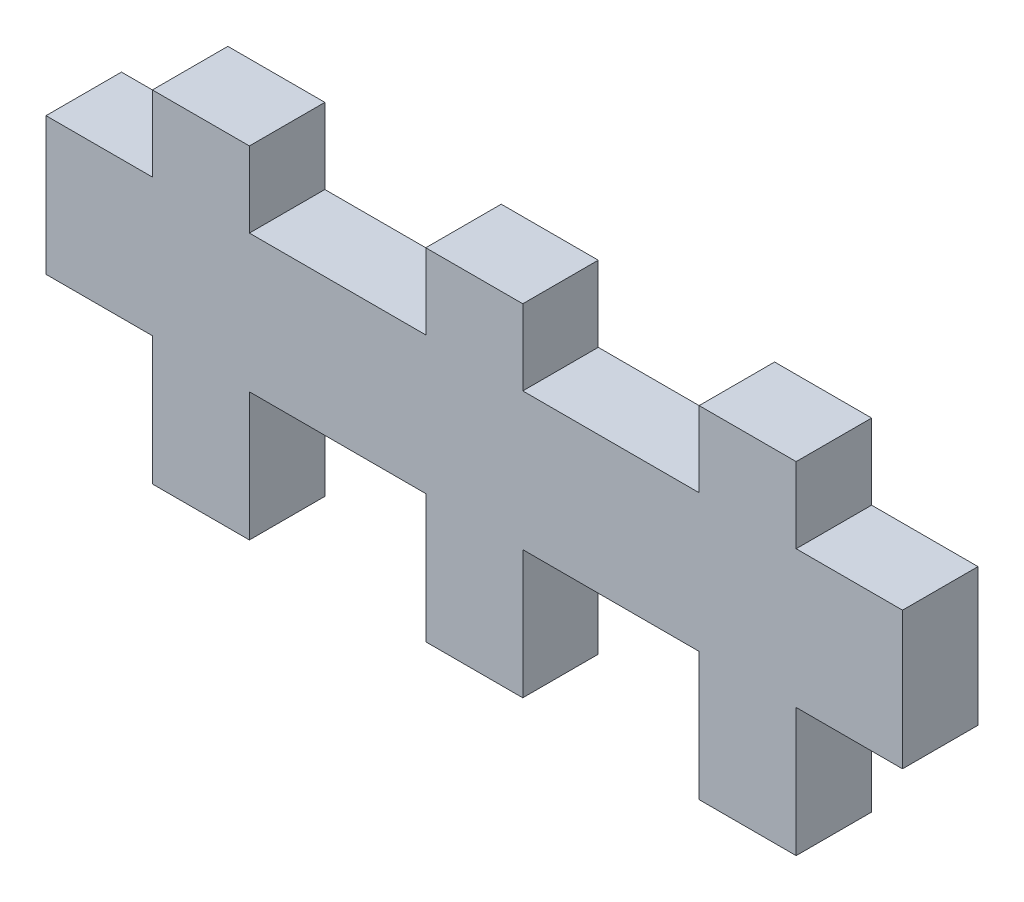
ISO-10303-21;
HEADER;
FILE_DESCRIPTION(('STEP AP214'),'2;1');
FILE_NAME('part.step','',(''),(''),'','','');
FILE_SCHEMA(('AUTOMOTIVE_DESIGN { 1 0 10303 214 1 1 1 1 }'));
ENDSEC;
DATA;
#1=APPLICATION_CONTEXT('core data for automotive mechanical design processes');
#2=APPLICATION_PROTOCOL_DEFINITION('international standard','automotive_design',2000,#1);
#3=PRODUCT_CONTEXT('',#1,'mechanical');
#4=PRODUCT('Part','Part','',(#3));
#5=PRODUCT_RELATED_PRODUCT_CATEGORY('part','',(#4));
#6=PRODUCT_DEFINITION_FORMATION('','',#4);
#7=PRODUCT_DEFINITION_CONTEXT('part definition',#1,'design');
#8=PRODUCT_DEFINITION('design','',#6,#7);
#9=PRODUCT_DEFINITION_SHAPE('','',#8);
#10=(LENGTH_UNIT() NAMED_UNIT(*) SI_UNIT(.MILLI.,.METRE.));
#11=(NAMED_UNIT(*) PLANE_ANGLE_UNIT() SI_UNIT($,.RADIAN.));
#12=(NAMED_UNIT(*) SI_UNIT($,.STERADIAN.) SOLID_ANGLE_UNIT());
#13=UNCERTAINTY_MEASURE_WITH_UNIT(LENGTH_MEASURE(1.E-05),#10,'distance_accuracy_value','');
#14=(GEOMETRIC_REPRESENTATION_CONTEXT(3) GLOBAL_UNCERTAINTY_ASSIGNED_CONTEXT((#13)) GLOBAL_UNIT_ASSIGNED_CONTEXT((#10,
#11,#12)) REPRESENTATION_CONTEXT('',''));
#15=CARTESIAN_POINT('',(0.,0.,0.));
#16=DIRECTION('',(0.,0.,1.));
#17=DIRECTION('',(1.,0.,0.));
#18=AXIS2_PLACEMENT_3D('',#15,#16,#17);
#19=CARTESIAN_POINT('',(-13.54064,8.91563999999998,0.));
#20=DIRECTION('',(-1.,0.,0.));
#21=DIRECTION('',(0.,0.,1.));
#22=AXIS2_PLACEMENT_3D('',#19,#20,#21);
#23=PLANE('',#22);
#24=DIRECTION('',(0.,-1.,0.));
#25=VECTOR('',#24,1.);
#26=CARTESIAN_POINT('',(-13.54064,8.91563999999998,3.175));
#27=LINE('',#26,#25);
#28=CARTESIAN_POINT('',(-13.54064,8.91563999999998,3.175));
#29=VERTEX_POINT('',#28);
#30=CARTESIAN_POINT('',(-13.54064,5.74063999999999,3.175));
#31=VERTEX_POINT('',#30);
#32=EDGE_CURVE('E255',#29,#31,#27,.T.);
#33=ORIENTED_EDGE('',*,*,#32,.F.);
#34=DIRECTION('',(0.,0.,1.));
#35=VECTOR('',#34,1.);
#36=CARTESIAN_POINT('',(-13.54064,8.91563999999998,0.));
#37=LINE('',#36,#35);
#38=CARTESIAN_POINT('',(-13.54064,8.91563999999998,0.));
#39=VERTEX_POINT('',#38);
#40=EDGE_CURVE('E11',#39,#29,#37,.T.);
#41=ORIENTED_EDGE('',*,*,#40,.F.);
#42=DIRECTION('',(0.,-1.,0.));
#43=VECTOR('',#42,1.);
#44=CARTESIAN_POINT('',(-13.54064,8.91563999999998,0.));
#45=LINE('',#44,#43);
#46=CARTESIAN_POINT('',(-13.54064,5.74063999999999,0.));
#47=VERTEX_POINT('',#46);
#48=EDGE_CURVE('E335',#39,#47,#45,.T.);
#49=ORIENTED_EDGE('',*,*,#48,.T.);
#50=DIRECTION('',(0.,0.,1.));
#51=VECTOR('',#50,1.);
#52=CARTESIAN_POINT('',(-13.54064,5.74063999999999,0.));
#53=LINE('',#52,#51);
#54=EDGE_CURVE('E42',#47,#31,#53,.T.);
#55=ORIENTED_EDGE('',*,*,#54,.T.);
#56=EDGE_LOOP('',(#33,#41,#49,#55));
#57=FACE_BOUND('',#56,.T.);
#58=ADVANCED_FACE('F38',(#57),#23,.T.);
#59=CARTESIAN_POINT('',(-9.45936000000001,8.91563999999998,0.));
#60=DIRECTION('',(0.,1.,0.));
#61=DIRECTION('',(-1.,0.,0.));
#62=AXIS2_PLACEMENT_3D('',#59,#60,#61);
#63=PLANE('',#62);
#64=DIRECTION('',(-1.,0.,0.));
#65=VECTOR('',#64,1.);
#66=CARTESIAN_POINT('',(-9.45936000000001,8.91563999999998,3.175));
#67=LINE('',#66,#65);
#68=CARTESIAN_POINT('',(-9.45936000000001,8.91563999999998,3.175));
#69=VERTEX_POINT('',#68);
#70=EDGE_CURVE('E333',#69,#29,#67,.T.);
#71=ORIENTED_EDGE('',*,*,#70,.F.);
#72=DIRECTION('',(0.,0.,1.));
#73=VECTOR('',#72,1.);
#74=CARTESIAN_POINT('',(-9.45936000000001,8.91563999999998,0.));
#75=LINE('',#74,#73);
#76=CARTESIAN_POINT('',(-9.45936000000001,8.91563999999998,0.));
#77=VERTEX_POINT('',#76);
#78=EDGE_CURVE('E48',#77,#69,#75,.T.);
#79=ORIENTED_EDGE('',*,*,#78,.F.);
#80=DIRECTION('',(-1.,0.,0.));
#81=VECTOR('',#80,1.);
#82=CARTESIAN_POINT('',(-9.45936000000001,8.91563999999998,0.));
#83=LINE('',#82,#81);
#84=EDGE_CURVE('E245',#77,#39,#83,.T.);
#85=ORIENTED_EDGE('',*,*,#84,.T.);
#86=ORIENTED_EDGE('',*,*,#40,.T.);
#87=EDGE_LOOP('',(#71,#79,#85,#86));
#88=FACE_BOUND('',#87,.T.);
#89=ADVANCED_FACE('F387',(#88),#63,.T.);
#90=CARTESIAN_POINT('',(-9.45936000000001,5.74063999999999,0.));
#91=DIRECTION('',(1.,0.,0.));
#92=DIRECTION('',(0.,0.,-1.));
#93=AXIS2_PLACEMENT_3D('',#90,#91,#92);
#94=PLANE('',#93);
#95=DIRECTION('',(0.,1.,0.));
#96=VECTOR('',#95,1.);
#97=CARTESIAN_POINT('',(-9.45936000000001,5.74063999999999,3.175));
#98=LINE('',#97,#96);
#99=CARTESIAN_POINT('',(-9.45936000000001,5.74063999999999,3.175));
#100=VERTEX_POINT('',#99);
#101=EDGE_CURVE('E233',#100,#69,#98,.T.);
#102=ORIENTED_EDGE('',*,*,#101,.F.);
#103=DIRECTION('',(0.,0.,1.));
#104=VECTOR('',#103,1.);
#105=CARTESIAN_POINT('',(-9.45936000000001,5.74063999999999,0.));
#106=LINE('',#105,#104);
#107=CARTESIAN_POINT('',(-9.45936000000001,5.74063999999999,0.));
#108=VERTEX_POINT('',#107);
#109=EDGE_CURVE('E228',#108,#100,#106,.T.);
#110=ORIENTED_EDGE('',*,*,#109,.F.);
#111=DIRECTION('',(0.,1.,0.));
#112=VECTOR('',#111,1.);
#113=CARTESIAN_POINT('',(-9.45936000000001,5.74063999999999,0.));
#114=LINE('',#113,#112);
#115=EDGE_CURVE('E231',#108,#77,#114,.T.);
#116=ORIENTED_EDGE('',*,*,#115,.T.);
#117=ORIENTED_EDGE('',*,*,#78,.T.);
#118=EDGE_LOOP('',(#102,#110,#116,#117));
#119=FACE_BOUND('',#118,.T.);
#120=ADVANCED_FACE('F230',(#119),#94,.T.);
#121=CARTESIAN_POINT('',(-2.04063999999999,5.74063999999999,0.));
#122=DIRECTION('',(0.,1.,0.));
#123=DIRECTION('',(0.,0.,1.));
#124=AXIS2_PLACEMENT_3D('',#121,#122,#123);
#125=PLANE('',#124);
#126=DIRECTION('',(-1.,0.,0.));
#127=VECTOR('',#126,1.);
#128=CARTESIAN_POINT('',(-2.04063999999999,5.74063999999999,3.175));
#129=LINE('',#128,#127);
#130=CARTESIAN_POINT('',(-2.04063999999999,5.74063999999999,3.175));
#131=VERTEX_POINT('',#130);
#132=EDGE_CURVE('E330',#131,#100,#129,.T.);
#133=ORIENTED_EDGE('',*,*,#132,.F.);
#134=DIRECTION('',(0.,0.,1.));
#135=VECTOR('',#134,1.);
#136=CARTESIAN_POINT('',(-2.04063999999999,5.74063999999999,0.));
#137=LINE('',#136,#135);
#138=CARTESIAN_POINT('',(-2.04063999999999,5.74063999999999,0.));
#139=VERTEX_POINT('',#138);
#140=EDGE_CURVE('E238',#139,#131,#137,.T.);
#141=ORIENTED_EDGE('',*,*,#140,.F.);
#142=DIRECTION('',(-1.,0.,0.));
#143=VECTOR('',#142,1.);
#144=CARTESIAN_POINT('',(-2.04063999999999,5.74063999999999,0.));
#145=LINE('',#144,#143);
#146=EDGE_CURVE('E243',#139,#108,#145,.T.);
#147=ORIENTED_EDGE('',*,*,#146,.T.);
#148=ORIENTED_EDGE('',*,*,#109,.T.);
#149=EDGE_LOOP('',(#133,#141,#147,#148));
#150=FACE_BOUND('',#149,.T.);
#151=ADVANCED_FACE('F247',(#150),#125,.T.);
#152=CARTESIAN_POINT('',(-2.04063999999999,8.91563999999999,0.));
#153=DIRECTION('',(-1.,0.,0.));
#154=DIRECTION('',(0.,-1.,0.));
#155=AXIS2_PLACEMENT_3D('',#152,#153,#154);
#156=PLANE('',#155);
#157=DIRECTION('',(0.,-1.,0.));
#158=VECTOR('',#157,1.);
#159=CARTESIAN_POINT('',(-2.04063999999999,8.91563999999999,3.175));
#160=LINE('',#159,#158);
#161=CARTESIAN_POINT('',(-2.04063999999999,8.91563999999999,3.175));
#162=VERTEX_POINT('',#161);
#163=EDGE_CURVE('E327',#162,#131,#160,.T.);
#164=ORIENTED_EDGE('',*,*,#163,.F.);
#165=DIRECTION('',(0.,0.,1.));
#166=VECTOR('',#165,1.);
#167=CARTESIAN_POINT('',(-2.04063999999999,8.91563999999999,0.));
#168=LINE('',#167,#166);
#169=CARTESIAN_POINT('',(-2.04063999999999,8.91563999999999,0.));
#170=VERTEX_POINT('',#169);
#171=EDGE_CURVE('E339',#170,#162,#168,.T.);
#172=ORIENTED_EDGE('',*,*,#171,.F.);
#173=DIRECTION('',(0.,-1.,0.));
#174=VECTOR('',#173,1.);
#175=CARTESIAN_POINT('',(-2.04063999999999,8.91563999999999,0.));
#176=LINE('',#175,#174);
#177=EDGE_CURVE('E248',#170,#139,#176,.T.);
#178=ORIENTED_EDGE('',*,*,#177,.T.);
#179=ORIENTED_EDGE('',*,*,#140,.T.);
#180=EDGE_LOOP('',(#164,#172,#178,#179));
#181=FACE_BOUND('',#180,.T.);
#182=ADVANCED_FACE('F399',(#181),#156,.T.);
#183=CARTESIAN_POINT('',(2.04063999999999,8.91563999999999,0.));
#184=DIRECTION('',(0.,1.,0.));
#185=DIRECTION('',(0.,0.,1.));
#186=AXIS2_PLACEMENT_3D('',#183,#184,#185);
#187=PLANE('',#186);
#188=DIRECTION('',(-1.,0.,0.));
#189=VECTOR('',#188,1.);
#190=CARTESIAN_POINT('',(2.04063999999999,8.91563999999999,3.175));
#191=LINE('',#190,#189);
#192=CARTESIAN_POINT('',(2.04063999999999,8.91563999999999,3.175));
#193=VERTEX_POINT('',#192);
#194=EDGE_CURVE('E324',#193,#162,#191,.T.);
#195=ORIENTED_EDGE('',*,*,#194,.F.);
#196=DIRECTION('',(0.,0.,1.));
#197=VECTOR('',#196,1.);
#198=CARTESIAN_POINT('',(2.04063999999999,8.91563999999999,0.));
#199=LINE('',#198,#197);
#200=CARTESIAN_POINT('',(2.04063999999999,8.91563999999999,0.));
#201=VERTEX_POINT('',#200);
#202=EDGE_CURVE('E341',#201,#193,#199,.T.);
#203=ORIENTED_EDGE('',*,*,#202,.F.);
#204=DIRECTION('',(-1.,0.,0.));
#205=VECTOR('',#204,1.);
#206=CARTESIAN_POINT('',(2.04063999999999,8.91563999999999,0.));
#207=LINE('',#206,#205);
#208=EDGE_CURVE('E250',#201,#170,#207,.T.);
#209=ORIENTED_EDGE('',*,*,#208,.T.);
#210=ORIENTED_EDGE('',*,*,#171,.T.);
#211=EDGE_LOOP('',(#195,#203,#209,#210));
#212=FACE_BOUND('',#211,.T.);
#213=ADVANCED_FACE('F402',(#212),#187,.T.);
#214=CARTESIAN_POINT('',(2.04063999999999,5.74063999999999,0.));
#215=DIRECTION('',(1.,0.,0.));
#216=DIRECTION('',(0.,1.,0.));
#217=AXIS2_PLACEMENT_3D('',#214,#215,#216);
#218=PLANE('',#217);
#219=DIRECTION('',(0.,1.,0.));
#220=VECTOR('',#219,1.);
#221=CARTESIAN_POINT('',(2.04063999999999,5.74063999999999,3.175));
#222=LINE('',#221,#220);
#223=CARTESIAN_POINT('',(2.04063999999999,5.74063999999999,3.175));
#224=VERTEX_POINT('',#223);
#225=EDGE_CURVE('E321',#224,#193,#222,.T.);
#226=ORIENTED_EDGE('',*,*,#225,.F.);
#227=DIRECTION('',(0.,0.,1.));
#228=VECTOR('',#227,1.);
#229=CARTESIAN_POINT('',(2.04063999999999,5.74063999999999,0.));
#230=LINE('',#229,#228);
#231=CARTESIAN_POINT('',(2.04063999999999,5.74063999999999,0.));
#232=VERTEX_POINT('',#231);
#233=EDGE_CURVE('E343',#232,#224,#230,.T.);
#234=ORIENTED_EDGE('',*,*,#233,.F.);
#235=DIRECTION('',(0.,1.,0.));
#236=VECTOR('',#235,1.);
#237=CARTESIAN_POINT('',(2.04063999999999,5.74063999999999,0.));
#238=LINE('',#237,#236);
#239=EDGE_CURVE('E808',#232,#201,#238,.T.);
#240=ORIENTED_EDGE('',*,*,#239,.T.);
#241=ORIENTED_EDGE('',*,*,#202,.T.);
#242=EDGE_LOOP('',(#226,#234,#240,#241));
#243=FACE_BOUND('',#242,.T.);
#244=ADVANCED_FACE('F406',(#243),#218,.T.);
#245=CARTESIAN_POINT('',(9.45936000000007,5.74063999999999,0.));
#246=DIRECTION('',(0.,1.,0.));
#247=DIRECTION('',(0.,0.,1.));
#248=AXIS2_PLACEMENT_3D('',#245,#246,#247);
#249=PLANE('',#248);
#250=DIRECTION('',(-1.,0.,0.));
#251=VECTOR('',#250,1.);
#252=CARTESIAN_POINT('',(9.45936000000007,5.74063999999999,3.175));
#253=LINE('',#252,#251);
#254=CARTESIAN_POINT('',(9.45936000000007,5.74063999999999,3.175));
#255=VERTEX_POINT('',#254);
#256=EDGE_CURVE('E318',#255,#224,#253,.T.);
#257=ORIENTED_EDGE('',*,*,#256,.F.);
#258=DIRECTION('',(0.,0.,1.));
#259=VECTOR('',#258,1.);
#260=CARTESIAN_POINT('',(9.45936000000007,5.74063999999999,0.));
#261=LINE('',#260,#259);
#262=CARTESIAN_POINT('',(9.45936000000007,5.74063999999999,0.));
#263=VERTEX_POINT('',#262);
#264=EDGE_CURVE('E345',#263,#255,#261,.T.);
#265=ORIENTED_EDGE('',*,*,#264,.F.);
#266=DIRECTION('',(-1.,0.,0.));
#267=VECTOR('',#266,1.);
#268=CARTESIAN_POINT('',(9.45936000000007,5.74063999999999,0.));
#269=LINE('',#268,#267);
#270=EDGE_CURVE('E804',#263,#232,#269,.T.);
#271=ORIENTED_EDGE('',*,*,#270,.T.);
#272=ORIENTED_EDGE('',*,*,#233,.T.);
#273=EDGE_LOOP('',(#257,#265,#271,#272));
#274=FACE_BOUND('',#273,.T.);
#275=ADVANCED_FACE('F410',(#274),#249,.T.);
#276=CARTESIAN_POINT('',(9.45936000000007,8.91563999999998,0.));
#277=DIRECTION('',(-1.,0.,0.));
#278=DIRECTION('',(0.,0.,1.));
#279=AXIS2_PLACEMENT_3D('',#276,#277,#278);
#280=PLANE('',#279);
#281=DIRECTION('',(0.,-1.,0.));
#282=VECTOR('',#281,1.);
#283=CARTESIAN_POINT('',(9.45936000000007,8.91563999999998,3.175));
#284=LINE('',#283,#282);
#285=CARTESIAN_POINT('',(9.45936000000007,8.91563999999998,3.175));
#286=VERTEX_POINT('',#285);
#287=EDGE_CURVE('E315',#286,#255,#284,.T.);
#288=ORIENTED_EDGE('',*,*,#287,.F.);
#289=DIRECTION('',(0.,0.,1.));
#290=VECTOR('',#289,1.);
#291=CARTESIAN_POINT('',(9.45936000000007,8.91563999999998,0.));
#292=LINE('',#291,#290);
#293=CARTESIAN_POINT('',(9.45936000000007,8.91563999999998,0.));
#294=VERTEX_POINT('',#293);
#295=EDGE_CURVE('E347',#294,#286,#292,.T.);
#296=ORIENTED_EDGE('',*,*,#295,.F.);
#297=DIRECTION('',(0.,-1.,0.));
#298=VECTOR('',#297,1.);
#299=CARTESIAN_POINT('',(9.45936000000007,8.91563999999998,0.));
#300=LINE('',#299,#298);
#301=EDGE_CURVE('E815',#294,#263,#300,.T.);
#302=ORIENTED_EDGE('',*,*,#301,.T.);
#303=ORIENTED_EDGE('',*,*,#264,.T.);
#304=EDGE_LOOP('',(#288,#296,#302,#303));
#305=FACE_BOUND('',#304,.T.);
#306=ADVANCED_FACE('F414',(#305),#280,.T.);
#307=CARTESIAN_POINT('',(13.5406400000001,8.91563999999997,0.));
#308=DIRECTION('',(0.,1.,0.));
#309=DIRECTION('',(-1.,0.,0.));
#310=AXIS2_PLACEMENT_3D('',#307,#308,#309);
#311=PLANE('',#310);
#312=DIRECTION('',(-1.,0.,0.));
#313=VECTOR('',#312,1.);
#314=CARTESIAN_POINT('',(13.5406400000001,8.91563999999997,3.175));
#315=LINE('',#314,#313);
#316=CARTESIAN_POINT('',(13.5406400000001,8.91563999999997,3.175));
#317=VERTEX_POINT('',#316);
#318=EDGE_CURVE('E312',#317,#286,#315,.T.);
#319=ORIENTED_EDGE('',*,*,#318,.F.);
#320=DIRECTION('',(0.,0.,1.));
#321=VECTOR('',#320,1.);
#322=CARTESIAN_POINT('',(13.5406400000001,8.91563999999997,0.));
#323=LINE('',#322,#321);
#324=CARTESIAN_POINT('',(13.5406400000001,8.91563999999997,0.));
#325=VERTEX_POINT('',#324);
#326=EDGE_CURVE('E349',#325,#317,#323,.T.);
#327=ORIENTED_EDGE('',*,*,#326,.F.);
#328=DIRECTION('',(-1.,0.,0.));
#329=VECTOR('',#328,1.);
#330=CARTESIAN_POINT('',(13.5406400000001,8.91563999999997,0.));
#331=LINE('',#330,#329);
#332=EDGE_CURVE('E797',#325,#294,#331,.T.);
#333=ORIENTED_EDGE('',*,*,#332,.T.);
#334=ORIENTED_EDGE('',*,*,#295,.T.);
#335=EDGE_LOOP('',(#319,#327,#333,#334));
#336=FACE_BOUND('',#335,.T.);
#337=ADVANCED_FACE('F418',(#336),#311,.T.);
#338=CARTESIAN_POINT('',(13.5406400000001,5.74063999999999,0.));
#339=DIRECTION('',(1.,0.,0.));
#340=DIRECTION('',(0.,1.,0.));
#341=AXIS2_PLACEMENT_3D('',#338,#339,#340);
#342=PLANE('',#341);
#343=DIRECTION('',(0.,1.,0.));
#344=VECTOR('',#343,1.);
#345=CARTESIAN_POINT('',(13.5406400000001,5.74063999999999,3.175));
#346=LINE('',#345,#344);
#347=CARTESIAN_POINT('',(13.5406400000001,5.74063999999999,3.175));
#348=VERTEX_POINT('',#347);
#349=EDGE_CURVE('E309',#348,#317,#346,.T.);
#350=ORIENTED_EDGE('',*,*,#349,.F.);
#351=DIRECTION('',(0.,0.,1.));
#352=VECTOR('',#351,1.);
#353=CARTESIAN_POINT('',(13.5406400000001,5.74063999999999,0.));
#354=LINE('',#353,#352);
#355=CARTESIAN_POINT('',(13.5406400000001,5.74063999999999,0.));
#356=VERTEX_POINT('',#355);
#357=EDGE_CURVE('E351',#356,#348,#354,.T.);
#358=ORIENTED_EDGE('',*,*,#357,.F.);
#359=DIRECTION('',(0.,1.,0.));
#360=VECTOR('',#359,1.);
#361=CARTESIAN_POINT('',(13.5406400000001,5.74063999999999,0.));
#362=LINE('',#361,#360);
#363=EDGE_CURVE('E793',#356,#325,#362,.T.);
#364=ORIENTED_EDGE('',*,*,#363,.T.);
#365=ORIENTED_EDGE('',*,*,#326,.T.);
#366=EDGE_LOOP('',(#350,#358,#364,#365));
#367=FACE_BOUND('',#366,.T.);
#368=ADVANCED_FACE('F422',(#367),#342,.T.);
#369=CARTESIAN_POINT('',(18.01564,5.74063999999999,0.));
#370=DIRECTION('',(0.,1.,0.));
#371=DIRECTION('',(0.,0.,1.));
#372=AXIS2_PLACEMENT_3D('',#369,#370,#371);
#373=PLANE('',#372);
#374=DIRECTION('',(-1.,0.,0.));
#375=VECTOR('',#374,1.);
#376=CARTESIAN_POINT('',(18.01564,5.74063999999999,3.175));
#377=LINE('',#376,#375);
#378=CARTESIAN_POINT('',(18.01564,5.74063999999999,3.175));
#379=VERTEX_POINT('',#378);
#380=EDGE_CURVE('E306',#379,#348,#377,.T.);
#381=ORIENTED_EDGE('',*,*,#380,.F.);
#382=DIRECTION('',(0.,0.,1.));
#383=VECTOR('',#382,1.);
#384=CARTESIAN_POINT('',(18.01564,5.74063999999999,0.));
#385=LINE('',#384,#383);
#386=CARTESIAN_POINT('',(18.01564,5.74063999999999,0.));
#387=VERTEX_POINT('',#386);
#388=EDGE_CURVE('E353',#387,#379,#385,.T.);
#389=ORIENTED_EDGE('',*,*,#388,.F.);
#390=DIRECTION('',(-1.,0.,0.));
#391=VECTOR('',#390,1.);
#392=CARTESIAN_POINT('',(18.01564,5.74063999999999,0.));
#393=LINE('',#392,#391);
#394=EDGE_CURVE('E819',#387,#356,#393,.T.);
#395=ORIENTED_EDGE('',*,*,#394,.T.);
#396=ORIENTED_EDGE('',*,*,#357,.T.);
#397=EDGE_LOOP('',(#381,#389,#395,#396));
#398=FACE_BOUND('',#397,.T.);
#399=ADVANCED_FACE('F426',(#398),#373,.T.);
#400=CARTESIAN_POINT('',(18.01564,-0.04064,0.));
#401=DIRECTION('',(1.,0.,0.));
#402=DIRECTION('',(0.,0.,-1.));
#403=AXIS2_PLACEMENT_3D('',#400,#401,#402);
#404=PLANE('',#403);
#405=DIRECTION('',(0.,1.,0.));
#406=VECTOR('',#405,1.);
#407=CARTESIAN_POINT('',(18.01564,-0.04064,3.175));
#408=LINE('',#407,#406);
#409=CARTESIAN_POINT('',(18.01564,-0.04064,3.175));
#410=VERTEX_POINT('',#409);
#411=EDGE_CURVE('E303',#410,#379,#408,.T.);
#412=ORIENTED_EDGE('',*,*,#411,.F.);
#413=DIRECTION('',(0.,0.,1.));
#414=VECTOR('',#413,1.);
#415=CARTESIAN_POINT('',(18.01564,-0.04064,0.));
#416=LINE('',#415,#414);
#417=CARTESIAN_POINT('',(18.01564,-0.04064,0.));
#418=VERTEX_POINT('',#417);
#419=EDGE_CURVE('E355',#418,#410,#416,.T.);
#420=ORIENTED_EDGE('',*,*,#419,.F.);
#421=DIRECTION('',(0.,1.,0.));
#422=VECTOR('',#421,1.);
#423=CARTESIAN_POINT('',(18.01564,-0.04064,0.));
#424=LINE('',#423,#422);
#425=EDGE_CURVE('E786',#418,#387,#424,.T.);
#426=ORIENTED_EDGE('',*,*,#425,.T.);
#427=ORIENTED_EDGE('',*,*,#388,.T.);
#428=EDGE_LOOP('',(#412,#420,#426,#427));
#429=FACE_BOUND('',#428,.T.);
#430=ADVANCED_FACE('F430',(#429),#404,.T.);
#431=CARTESIAN_POINT('',(13.5406400000001,-0.04064,0.));
#432=DIRECTION('',(0.,-1.,0.));
#433=DIRECTION('',(0.,0.,-1.));
#434=AXIS2_PLACEMENT_3D('',#431,#432,#433);
#435=PLANE('',#434);
#436=DIRECTION('',(1.,0.,0.));
#437=VECTOR('',#436,1.);
#438=CARTESIAN_POINT('',(13.5406400000001,-0.04064,3.175));
#439=LINE('',#438,#437);
#440=CARTESIAN_POINT('',(13.5406400000001,-0.04064,3.175));
#441=VERTEX_POINT('',#440);
#442=EDGE_CURVE('E300',#441,#410,#439,.T.);
#443=ORIENTED_EDGE('',*,*,#442,.F.);
#444=DIRECTION('',(0.,0.,1.));
#445=VECTOR('',#444,1.);
#446=CARTESIAN_POINT('',(13.5406400000001,-0.04064,0.));
#447=LINE('',#446,#445);
#448=CARTESIAN_POINT('',(13.5406400000001,-0.04064,0.));
#449=VERTEX_POINT('',#448);
#450=EDGE_CURVE('E357',#449,#441,#447,.T.);
#451=ORIENTED_EDGE('',*,*,#450,.F.);
#452=DIRECTION('',(1.,0.,0.));
#453=VECTOR('',#452,1.);
#454=CARTESIAN_POINT('',(13.5406400000001,-0.04064,0.));
#455=LINE('',#454,#453);
#456=EDGE_CURVE('E782',#449,#418,#455,.T.);
#457=ORIENTED_EDGE('',*,*,#456,.T.);
#458=ORIENTED_EDGE('',*,*,#419,.T.);
#459=EDGE_LOOP('',(#443,#451,#457,#458));
#460=FACE_BOUND('',#459,.T.);
#461=ADVANCED_FACE('F434',(#460),#435,.T.);
#462=CARTESIAN_POINT('',(13.54064,-5.44064,0.));
#463=DIRECTION('',(1.,0.,0.));
#464=DIRECTION('',(0.,1.,0.));
#465=AXIS2_PLACEMENT_3D('',#462,#463,#464);
#466=PLANE('',#465);
#467=DIRECTION('',(0.,1.,0.));
#468=VECTOR('',#467,1.);
#469=CARTESIAN_POINT('',(13.54064,-5.44064,3.175));
#470=LINE('',#469,#468);
#471=CARTESIAN_POINT('',(13.54064,-5.44064,3.175));
#472=VERTEX_POINT('',#471);
#473=EDGE_CURVE('E297',#472,#441,#470,.T.);
#474=ORIENTED_EDGE('',*,*,#473,.F.);
#475=DIRECTION('',(0.,0.,1.));
#476=VECTOR('',#475,1.);
#477=CARTESIAN_POINT('',(13.54064,-5.44064,0.));
#478=LINE('',#477,#476);
#479=CARTESIAN_POINT('',(13.54064,-5.44064,0.));
#480=VERTEX_POINT('',#479);
#481=EDGE_CURVE('E359',#480,#472,#478,.T.);
#482=ORIENTED_EDGE('',*,*,#481,.F.);
#483=DIRECTION('',(0.,1.,0.));
#484=VECTOR('',#483,1.);
#485=CARTESIAN_POINT('',(13.54064,-5.44064,0.));
#486=LINE('',#485,#484);
#487=EDGE_CURVE('E823',#480,#449,#486,.T.);
#488=ORIENTED_EDGE('',*,*,#487,.T.);
#489=ORIENTED_EDGE('',*,*,#450,.T.);
#490=EDGE_LOOP('',(#474,#482,#488,#489));
#491=FACE_BOUND('',#490,.T.);
#492=ADVANCED_FACE('F438',(#491),#466,.T.);
#493=CARTESIAN_POINT('',(9.45935999999999,-5.44064,0.));
#494=DIRECTION('',(0.,-1.,0.));
#495=DIRECTION('',(0.,0.,-1.));
#496=AXIS2_PLACEMENT_3D('',#493,#494,#495);
#497=PLANE('',#496);
#498=DIRECTION('',(1.,0.,0.));
#499=VECTOR('',#498,1.);
#500=CARTESIAN_POINT('',(9.45935999999999,-5.44064,3.175));
#501=LINE('',#500,#499);
#502=CARTESIAN_POINT('',(9.45935999999999,-5.44064,3.175));
#503=VERTEX_POINT('',#502);
#504=EDGE_CURVE('E294',#503,#472,#501,.T.);
#505=ORIENTED_EDGE('',*,*,#504,.F.);
#506=DIRECTION('',(0.,0.,1.));
#507=VECTOR('',#506,1.);
#508=CARTESIAN_POINT('',(9.45935999999999,-5.44064,0.));
#509=LINE('',#508,#507);
#510=CARTESIAN_POINT('',(9.45935999999999,-5.44064,0.));
#511=VERTEX_POINT('',#510);
#512=EDGE_CURVE('E361',#511,#503,#509,.T.);
#513=ORIENTED_EDGE('',*,*,#512,.F.);
#514=DIRECTION('',(1.,0.,0.));
#515=VECTOR('',#514,1.);
#516=CARTESIAN_POINT('',(9.45935999999999,-5.44064,0.));
#517=LINE('',#516,#515);
#518=EDGE_CURVE('E775',#511,#480,#517,.T.);
#519=ORIENTED_EDGE('',*,*,#518,.T.);
#520=ORIENTED_EDGE('',*,*,#481,.T.);
#521=EDGE_LOOP('',(#505,#513,#519,#520));
#522=FACE_BOUND('',#521,.T.);
#523=ADVANCED_FACE('F442',(#522),#497,.T.);
#524=CARTESIAN_POINT('',(9.45936000000006,-0.04064,0.));
#525=DIRECTION('',(-1.,0.,0.));
#526=DIRECTION('',(0.,-1.,0.));
#527=AXIS2_PLACEMENT_3D('',#524,#525,#526);
#528=PLANE('',#527);
#529=DIRECTION('',(0.,-1.,0.));
#530=VECTOR('',#529,1.);
#531=CARTESIAN_POINT('',(9.45936000000006,-0.04064,3.175));
#532=LINE('',#531,#530);
#533=CARTESIAN_POINT('',(9.45936000000006,-0.04064,3.175));
#534=VERTEX_POINT('',#533);
#535=EDGE_CURVE('E291',#534,#503,#532,.T.);
#536=ORIENTED_EDGE('',*,*,#535,.F.);
#537=DIRECTION('',(0.,0.,1.));
#538=VECTOR('',#537,1.);
#539=CARTESIAN_POINT('',(9.45936000000006,-0.04064,0.));
#540=LINE('',#539,#538);
#541=CARTESIAN_POINT('',(9.45936000000006,-0.04064,0.));
#542=VERTEX_POINT('',#541);
#543=EDGE_CURVE('E363',#542,#534,#540,.T.);
#544=ORIENTED_EDGE('',*,*,#543,.F.);
#545=DIRECTION('',(0.,-1.,0.));
#546=VECTOR('',#545,1.);
#547=CARTESIAN_POINT('',(9.45936000000006,-0.04064,0.));
#548=LINE('',#547,#546);
#549=EDGE_CURVE('E771',#542,#511,#548,.T.);
#550=ORIENTED_EDGE('',*,*,#549,.T.);
#551=ORIENTED_EDGE('',*,*,#512,.T.);
#552=EDGE_LOOP('',(#536,#544,#550,#551));
#553=FACE_BOUND('',#552,.T.);
#554=ADVANCED_FACE('F446',(#553),#528,.T.);
#555=CARTESIAN_POINT('',(2.04064000000001,-0.04064,0.));
#556=DIRECTION('',(0.,-1.,0.));
#557=DIRECTION('',(0.,0.,-1.));
#558=AXIS2_PLACEMENT_3D('',#555,#556,#557);
#559=PLANE('',#558);
#560=DIRECTION('',(1.,0.,0.));
#561=VECTOR('',#560,1.);
#562=CARTESIAN_POINT('',(2.04064000000001,-0.04064,3.175));
#563=LINE('',#562,#561);
#564=CARTESIAN_POINT('',(2.04064000000001,-0.04064,3.175));
#565=VERTEX_POINT('',#564);
#566=EDGE_CURVE('E288',#565,#534,#563,.T.);
#567=ORIENTED_EDGE('',*,*,#566,.F.);
#568=DIRECTION('',(0.,0.,1.));
#569=VECTOR('',#568,1.);
#570=CARTESIAN_POINT('',(2.04064000000001,-0.04064,0.));
#571=LINE('',#570,#569);
#572=CARTESIAN_POINT('',(2.04064000000001,-0.04064,0.));
#573=VERTEX_POINT('',#572);
#574=EDGE_CURVE('E365',#573,#565,#571,.T.);
#575=ORIENTED_EDGE('',*,*,#574,.F.);
#576=DIRECTION('',(1.,0.,0.));
#577=VECTOR('',#576,1.);
#578=CARTESIAN_POINT('',(2.04064000000001,-0.04064,0.));
#579=LINE('',#578,#577);
#580=EDGE_CURVE('E827',#573,#542,#579,.T.);
#581=ORIENTED_EDGE('',*,*,#580,.T.);
#582=ORIENTED_EDGE('',*,*,#543,.T.);
#583=EDGE_LOOP('',(#567,#575,#581,#582));
#584=FACE_BOUND('',#583,.T.);
#585=ADVANCED_FACE('F450',(#584),#559,.T.);
#586=CARTESIAN_POINT('',(2.04063999999999,-5.44064,0.));
#587=DIRECTION('',(1.,0.,0.));
#588=DIRECTION('',(0.,1.,0.));
#589=AXIS2_PLACEMENT_3D('',#586,#587,#588);
#590=PLANE('',#589);
#591=DIRECTION('',(0.,1.,0.));
#592=VECTOR('',#591,1.);
#593=CARTESIAN_POINT('',(2.04063999999999,-5.44064,3.175));
#594=LINE('',#593,#592);
#595=CARTESIAN_POINT('',(2.04063999999999,-5.44064,3.175));
#596=VERTEX_POINT('',#595);
#597=EDGE_CURVE('E285',#596,#565,#594,.T.);
#598=ORIENTED_EDGE('',*,*,#597,.F.);
#599=DIRECTION('',(0.,0.,1.));
#600=VECTOR('',#599,1.);
#601=CARTESIAN_POINT('',(2.04063999999999,-5.44064,0.));
#602=LINE('',#601,#600);
#603=CARTESIAN_POINT('',(2.04063999999999,-5.44064,0.));
#604=VERTEX_POINT('',#603);
#605=EDGE_CURVE('E367',#604,#596,#602,.T.);
#606=ORIENTED_EDGE('',*,*,#605,.F.);
#607=DIRECTION('',(0.,1.,0.));
#608=VECTOR('',#607,1.);
#609=CARTESIAN_POINT('',(2.04063999999999,-5.44064,0.));
#610=LINE('',#609,#608);
#611=EDGE_CURVE('E764',#604,#573,#610,.T.);
#612=ORIENTED_EDGE('',*,*,#611,.T.);
#613=ORIENTED_EDGE('',*,*,#574,.T.);
#614=EDGE_LOOP('',(#598,#606,#612,#613));
#615=FACE_BOUND('',#614,.T.);
#616=ADVANCED_FACE('F454',(#615),#590,.T.);
#617=CARTESIAN_POINT('',(-2.04064000000001,-5.44064,0.));
#618=DIRECTION('',(0.,-1.,0.));
#619=DIRECTION('',(0.,0.,-1.));
#620=AXIS2_PLACEMENT_3D('',#617,#618,#619);
#621=PLANE('',#620);
#622=DIRECTION('',(1.,0.,0.));
#623=VECTOR('',#622,1.);
#624=CARTESIAN_POINT('',(-2.04064000000001,-5.44064,3.175));
#625=LINE('',#624,#623);
#626=CARTESIAN_POINT('',(-2.04064000000001,-5.44064,3.175));
#627=VERTEX_POINT('',#626);
#628=EDGE_CURVE('E282',#627,#596,#625,.T.);
#629=ORIENTED_EDGE('',*,*,#628,.F.);
#630=DIRECTION('',(0.,0.,1.));
#631=VECTOR('',#630,1.);
#632=CARTESIAN_POINT('',(-2.04064000000001,-5.44064,0.));
#633=LINE('',#632,#631);
#634=CARTESIAN_POINT('',(-2.04064000000001,-5.44064,0.));
#635=VERTEX_POINT('',#634);
#636=EDGE_CURVE('E369',#635,#627,#633,.T.);
#637=ORIENTED_EDGE('',*,*,#636,.F.);
#638=DIRECTION('',(1.,0.,0.));
#639=VECTOR('',#638,1.);
#640=CARTESIAN_POINT('',(-2.04064000000001,-5.44064,0.));
#641=LINE('',#640,#639);
#642=EDGE_CURVE('E760',#635,#604,#641,.T.);
#643=ORIENTED_EDGE('',*,*,#642,.T.);
#644=ORIENTED_EDGE('',*,*,#605,.T.);
#645=EDGE_LOOP('',(#629,#637,#643,#644));
#646=FACE_BOUND('',#645,.T.);
#647=ADVANCED_FACE('F458',(#646),#621,.T.);
#648=CARTESIAN_POINT('',(-2.04064,-0.04064,0.));
#649=DIRECTION('',(-1.,0.,0.));
#650=DIRECTION('',(0.,-1.,0.));
#651=AXIS2_PLACEMENT_3D('',#648,#649,#650);
#652=PLANE('',#651);
#653=DIRECTION('',(0.,-1.,0.));
#654=VECTOR('',#653,1.);
#655=CARTESIAN_POINT('',(-2.04064,-0.04064,3.175));
#656=LINE('',#655,#654);
#657=CARTESIAN_POINT('',(-2.04064,-0.04064,3.175));
#658=VERTEX_POINT('',#657);
#659=EDGE_CURVE('E279',#658,#627,#656,.T.);
#660=ORIENTED_EDGE('',*,*,#659,.F.);
#661=DIRECTION('',(0.,0.,1.));
#662=VECTOR('',#661,1.);
#663=CARTESIAN_POINT('',(-2.04064,-0.04064,0.));
#664=LINE('',#663,#662);
#665=CARTESIAN_POINT('',(-2.04064,-0.04064,0.));
#666=VERTEX_POINT('',#665);
#667=EDGE_CURVE('E371',#666,#658,#664,.T.);
#668=ORIENTED_EDGE('',*,*,#667,.F.);
#669=DIRECTION('',(0.,-1.,0.));
#670=VECTOR('',#669,1.);
#671=CARTESIAN_POINT('',(-2.04064,-0.04064,0.));
#672=LINE('',#671,#670);
#673=EDGE_CURVE('E831',#666,#635,#672,.T.);
#674=ORIENTED_EDGE('',*,*,#673,.T.);
#675=ORIENTED_EDGE('',*,*,#636,.T.);
#676=EDGE_LOOP('',(#660,#668,#674,#675));
#677=FACE_BOUND('',#676,.T.);
#678=ADVANCED_FACE('F462',(#677),#652,.T.);
#679=CARTESIAN_POINT('',(-9.45936,-0.04064,0.));
#680=DIRECTION('',(0.,-1.,0.));
#681=DIRECTION('',(0.,0.,-1.));
#682=AXIS2_PLACEMENT_3D('',#679,#680,#681);
#683=PLANE('',#682);
#684=DIRECTION('',(1.,0.,0.));
#685=VECTOR('',#684,1.);
#686=CARTESIAN_POINT('',(-9.45936,-0.04064,3.175));
#687=LINE('',#686,#685);
#688=CARTESIAN_POINT('',(-9.45936,-0.04064,3.175));
#689=VERTEX_POINT('',#688);
#690=EDGE_CURVE('E276',#689,#658,#687,.T.);
#691=ORIENTED_EDGE('',*,*,#690,.F.);
#692=DIRECTION('',(0.,0.,1.));
#693=VECTOR('',#692,1.);
#694=CARTESIAN_POINT('',(-9.45936,-0.04064,0.));
#695=LINE('',#694,#693);
#696=CARTESIAN_POINT('',(-9.45936,-0.04064,0.));
#697=VERTEX_POINT('',#696);
#698=EDGE_CURVE('E373',#697,#689,#695,.T.);
#699=ORIENTED_EDGE('',*,*,#698,.F.);
#700=DIRECTION('',(1.,0.,0.));
#701=VECTOR('',#700,1.);
#702=CARTESIAN_POINT('',(-9.45936,-0.04064,0.));
#703=LINE('',#702,#701);
#704=EDGE_CURVE('E753',#697,#666,#703,.T.);
#705=ORIENTED_EDGE('',*,*,#704,.T.);
#706=ORIENTED_EDGE('',*,*,#667,.T.);
#707=EDGE_LOOP('',(#691,#699,#705,#706));
#708=FACE_BOUND('',#707,.T.);
#709=ADVANCED_FACE('F466',(#708),#683,.T.);
#710=CARTESIAN_POINT('',(-9.45936000000001,-5.44064,0.));
#711=DIRECTION('',(1.,0.,0.));
#712=DIRECTION('',(0.,1.,0.));
#713=AXIS2_PLACEMENT_3D('',#710,#711,#712);
#714=PLANE('',#713);
#715=DIRECTION('',(0.,1.,0.));
#716=VECTOR('',#715,1.);
#717=CARTESIAN_POINT('',(-9.45936000000001,-5.44064,3.175));
#718=LINE('',#717,#716);
#719=CARTESIAN_POINT('',(-9.45936000000001,-5.44064,3.175));
#720=VERTEX_POINT('',#719);
#721=EDGE_CURVE('E273',#720,#689,#718,.T.);
#722=ORIENTED_EDGE('',*,*,#721,.F.);
#723=DIRECTION('',(0.,0.,1.));
#724=VECTOR('',#723,1.);
#725=CARTESIAN_POINT('',(-9.45936000000001,-5.44064,0.));
#726=LINE('',#725,#724);
#727=CARTESIAN_POINT('',(-9.45936000000001,-5.44064,0.));
#728=VERTEX_POINT('',#727);
#729=EDGE_CURVE('E375',#728,#720,#726,.T.);
#730=ORIENTED_EDGE('',*,*,#729,.F.);
#731=DIRECTION('',(0.,1.,0.));
#732=VECTOR('',#731,1.);
#733=CARTESIAN_POINT('',(-9.45936000000001,-5.44064,0.));
#734=LINE('',#733,#732);
#735=EDGE_CURVE('E749',#728,#697,#734,.T.);
#736=ORIENTED_EDGE('',*,*,#735,.T.);
#737=ORIENTED_EDGE('',*,*,#698,.T.);
#738=EDGE_LOOP('',(#722,#730,#736,#737));
#739=FACE_BOUND('',#738,.T.);
#740=ADVANCED_FACE('F470',(#739),#714,.T.);
#741=CARTESIAN_POINT('',(-13.54064,-5.44064,0.));
#742=DIRECTION('',(0.,-1.,0.));
#743=DIRECTION('',(0.,0.,-1.));
#744=AXIS2_PLACEMENT_3D('',#741,#742,#743);
#745=PLANE('',#744);
#746=DIRECTION('',(1.,0.,0.));
#747=VECTOR('',#746,1.);
#748=CARTESIAN_POINT('',(-13.54064,-5.44064,3.175));
#749=LINE('',#748,#747);
#750=CARTESIAN_POINT('',(-13.54064,-5.44064,3.175));
#751=VERTEX_POINT('',#750);
#752=EDGE_CURVE('E270',#751,#720,#749,.T.);
#753=ORIENTED_EDGE('',*,*,#752,.F.);
#754=DIRECTION('',(0.,0.,1.));
#755=VECTOR('',#754,1.);
#756=CARTESIAN_POINT('',(-13.54064,-5.44064,0.));
#757=LINE('',#756,#755);
#758=CARTESIAN_POINT('',(-13.54064,-5.44064,0.));
#759=VERTEX_POINT('',#758);
#760=EDGE_CURVE('E377',#759,#751,#757,.T.);
#761=ORIENTED_EDGE('',*,*,#760,.F.);
#762=DIRECTION('',(1.,0.,0.));
#763=VECTOR('',#762,1.);
#764=CARTESIAN_POINT('',(-13.54064,-5.44064,0.));
#765=LINE('',#764,#763);
#766=EDGE_CURVE('E835',#759,#728,#765,.T.);
#767=ORIENTED_EDGE('',*,*,#766,.T.);
#768=ORIENTED_EDGE('',*,*,#729,.T.);
#769=EDGE_LOOP('',(#753,#761,#767,#768));
#770=FACE_BOUND('',#769,.T.);
#771=ADVANCED_FACE('F474',(#770),#745,.T.);
#772=CARTESIAN_POINT('',(-13.54064,-0.04064,0.));
#773=DIRECTION('',(-1.,0.,0.));
#774=DIRECTION('',(0.,0.,1.));
#775=AXIS2_PLACEMENT_3D('',#772,#773,#774);
#776=PLANE('',#775);
#777=DIRECTION('',(0.,-1.,0.));
#778=VECTOR('',#777,1.);
#779=CARTESIAN_POINT('',(-13.54064,-0.04064,3.175));
#780=LINE('',#779,#778);
#781=CARTESIAN_POINT('',(-13.54064,-0.04064,3.175));
#782=VERTEX_POINT('',#781);
#783=EDGE_CURVE('E267',#782,#751,#780,.T.);
#784=ORIENTED_EDGE('',*,*,#783,.F.);
#785=DIRECTION('',(0.,0.,1.));
#786=VECTOR('',#785,1.);
#787=CARTESIAN_POINT('',(-13.54064,-0.04064,0.));
#788=LINE('',#787,#786);
#789=CARTESIAN_POINT('',(-13.54064,-0.04064,0.));
#790=VERTEX_POINT('',#789);
#791=EDGE_CURVE('E379',#790,#782,#788,.T.);
#792=ORIENTED_EDGE('',*,*,#791,.F.);
#793=DIRECTION('',(0.,-1.,0.));
#794=VECTOR('',#793,1.);
#795=CARTESIAN_POINT('',(-13.54064,-0.04064,0.));
#796=LINE('',#795,#794);
#797=EDGE_CURVE('E742',#790,#759,#796,.T.);
#798=ORIENTED_EDGE('',*,*,#797,.T.);
#799=ORIENTED_EDGE('',*,*,#760,.T.);
#800=EDGE_LOOP('',(#784,#792,#798,#799));
#801=FACE_BOUND('',#800,.T.);
#802=ADVANCED_FACE('F478',(#801),#776,.T.);
#803=CARTESIAN_POINT('',(-18.01564,-0.04064,0.));
#804=DIRECTION('',(0.,-1.,0.));
#805=DIRECTION('',(0.,0.,-1.));
#806=AXIS2_PLACEMENT_3D('',#803,#804,#805);
#807=PLANE('',#806);
#808=DIRECTION('',(1.,0.,0.));
#809=VECTOR('',#808,1.);
#810=CARTESIAN_POINT('',(-18.01564,-0.04064,3.175));
#811=LINE('',#810,#809);
#812=CARTESIAN_POINT('',(-18.01564,-0.04064,3.175));
#813=VERTEX_POINT('',#812);
#814=EDGE_CURVE('E264',#813,#782,#811,.T.);
#815=ORIENTED_EDGE('',*,*,#814,.F.);
#816=DIRECTION('',(0.,0.,1.));
#817=VECTOR('',#816,1.);
#818=CARTESIAN_POINT('',(-18.01564,-0.04064,0.));
#819=LINE('',#818,#817);
#820=CARTESIAN_POINT('',(-18.01564,-0.04064,0.));
#821=VERTEX_POINT('',#820);
#822=EDGE_CURVE('E381',#821,#813,#819,.T.);
#823=ORIENTED_EDGE('',*,*,#822,.F.);
#824=DIRECTION('',(1.,0.,0.));
#825=VECTOR('',#824,1.);
#826=CARTESIAN_POINT('',(-18.01564,-0.04064,0.));
#827=LINE('',#826,#825);
#828=EDGE_CURVE('E738',#821,#790,#827,.T.);
#829=ORIENTED_EDGE('',*,*,#828,.T.);
#830=ORIENTED_EDGE('',*,*,#791,.T.);
#831=EDGE_LOOP('',(#815,#823,#829,#830));
#832=FACE_BOUND('',#831,.T.);
#833=ADVANCED_FACE('F482',(#832),#807,.T.);
#834=CARTESIAN_POINT('',(-18.01564,5.74063999999999,0.));
#835=DIRECTION('',(-1.,0.,0.));
#836=DIRECTION('',(0.,0.,1.));
#837=AXIS2_PLACEMENT_3D('',#834,#835,#836);
#838=PLANE('',#837);
#839=DIRECTION('',(0.,-1.,0.));
#840=VECTOR('',#839,1.);
#841=CARTESIAN_POINT('',(-18.01564,5.74063999999999,3.175));
#842=LINE('',#841,#840);
#843=CARTESIAN_POINT('',(-18.01564,5.74063999999999,3.175));
#844=VERTEX_POINT('',#843);
#845=EDGE_CURVE('E261',#844,#813,#842,.T.);
#846=ORIENTED_EDGE('',*,*,#845,.F.);
#847=DIRECTION('',(0.,0.,1.));
#848=VECTOR('',#847,1.);
#849=CARTESIAN_POINT('',(-18.01564,5.74063999999999,0.));
#850=LINE('',#849,#848);
#851=CARTESIAN_POINT('',(-18.01564,5.74063999999999,0.));
#852=VERTEX_POINT('',#851);
#853=EDGE_CURVE('E382',#852,#844,#850,.T.);
#854=ORIENTED_EDGE('',*,*,#853,.F.);
#855=DIRECTION('',(0.,-1.,0.));
#856=VECTOR('',#855,1.);
#857=CARTESIAN_POINT('',(-18.01564,5.74063999999999,0.));
#858=LINE('',#857,#856);
#859=EDGE_CURVE('E839',#852,#821,#858,.T.);
#860=ORIENTED_EDGE('',*,*,#859,.T.);
#861=ORIENTED_EDGE('',*,*,#822,.T.);
#862=EDGE_LOOP('',(#846,#854,#860,#861));
#863=FACE_BOUND('',#862,.T.);
#864=ADVANCED_FACE('F486',(#863),#838,.T.);
#865=CARTESIAN_POINT('',(-13.54064,5.74063999999999,0.));
#866=DIRECTION('',(0.,1.,0.));
#867=DIRECTION('',(0.,0.,1.));
#868=AXIS2_PLACEMENT_3D('',#865,#866,#867);
#869=PLANE('',#868);
#870=DIRECTION('',(-1.,0.,0.));
#871=VECTOR('',#870,1.);
#872=CARTESIAN_POINT('',(-13.54064,5.74063999999999,3.175));
#873=LINE('',#872,#871);
#874=EDGE_CURVE('E258',#31,#844,#873,.T.);
#875=ORIENTED_EDGE('',*,*,#874,.F.);
#876=ORIENTED_EDGE('',*,*,#54,.F.);
#877=DIRECTION('',(-1.,0.,0.));
#878=VECTOR('',#877,1.);
#879=CARTESIAN_POINT('',(-13.54064,5.74063999999999,0.));
#880=LINE('',#879,#878);
#881=EDGE_CURVE('E841',#47,#852,#880,.T.);
#882=ORIENTED_EDGE('',*,*,#881,.T.);
#883=ORIENTED_EDGE('',*,*,#853,.T.);
#884=EDGE_LOOP('',(#875,#876,#882,#883));
#885=FACE_BOUND('',#884,.T.);
#886=ADVANCED_FACE('F384',(#885),#869,.T.);
#887=CARTESIAN_POINT('',(0.,0.,3.175));
#888=DIRECTION('',(0.,0.,1.));
#889=DIRECTION('',(1.,0.,0.));
#890=AXIS2_PLACEMENT_3D('',#887,#888,#889);
#891=PLANE('',#890);
#892=ORIENTED_EDGE('',*,*,#32,.T.);
#893=ORIENTED_EDGE('',*,*,#874,.T.);
#894=ORIENTED_EDGE('',*,*,#845,.T.);
#895=ORIENTED_EDGE('',*,*,#814,.T.);
#896=ORIENTED_EDGE('',*,*,#783,.T.);
#897=ORIENTED_EDGE('',*,*,#752,.T.);
#898=ORIENTED_EDGE('',*,*,#721,.T.);
#899=ORIENTED_EDGE('',*,*,#690,.T.);
#900=ORIENTED_EDGE('',*,*,#659,.T.);
#901=ORIENTED_EDGE('',*,*,#628,.T.);
#902=ORIENTED_EDGE('',*,*,#597,.T.);
#903=ORIENTED_EDGE('',*,*,#566,.T.);
#904=ORIENTED_EDGE('',*,*,#535,.T.);
#905=ORIENTED_EDGE('',*,*,#504,.T.);
#906=ORIENTED_EDGE('',*,*,#473,.T.);
#907=ORIENTED_EDGE('',*,*,#442,.T.);
#908=ORIENTED_EDGE('',*,*,#411,.T.);
#909=ORIENTED_EDGE('',*,*,#380,.T.);
#910=ORIENTED_EDGE('',*,*,#349,.T.);
#911=ORIENTED_EDGE('',*,*,#318,.T.);
#912=ORIENTED_EDGE('',*,*,#287,.T.);
#913=ORIENTED_EDGE('',*,*,#256,.T.);
#914=ORIENTED_EDGE('',*,*,#225,.T.);
#915=ORIENTED_EDGE('',*,*,#194,.T.);
#916=ORIENTED_EDGE('',*,*,#163,.T.);
#917=ORIENTED_EDGE('',*,*,#132,.T.);
#918=ORIENTED_EDGE('',*,*,#101,.T.);
#919=ORIENTED_EDGE('',*,*,#70,.T.);
#920=EDGE_LOOP('',(#892,#893,#894,#895,#896,#897,#898,#899,#900,#901,#902,#903,#904,#905,#906,
#907,#908,#909,#910,#911,#912,#913,#914,#915,#916,#917,#918,#919));
#921=FACE_BOUND('',#920,.T.);
#922=ADVANCED_FACE('F386',(#921),#891,.T.);
#923=CARTESIAN_POINT('',(0.,0.,0.));
#924=DIRECTION('',(0.,0.,1.));
#925=DIRECTION('',(1.,0.,0.));
#926=AXIS2_PLACEMENT_3D('',#923,#924,#925);
#927=PLANE('',#926);
#928=ORIENTED_EDGE('',*,*,#48,.F.);
#929=ORIENTED_EDGE('',*,*,#84,.F.);
#930=ORIENTED_EDGE('',*,*,#115,.F.);
#931=ORIENTED_EDGE('',*,*,#146,.F.);
#932=ORIENTED_EDGE('',*,*,#177,.F.);
#933=ORIENTED_EDGE('',*,*,#208,.F.);
#934=ORIENTED_EDGE('',*,*,#239,.F.);
#935=ORIENTED_EDGE('',*,*,#270,.F.);
#936=ORIENTED_EDGE('',*,*,#301,.F.);
#937=ORIENTED_EDGE('',*,*,#332,.F.);
#938=ORIENTED_EDGE('',*,*,#363,.F.);
#939=ORIENTED_EDGE('',*,*,#394,.F.);
#940=ORIENTED_EDGE('',*,*,#425,.F.);
#941=ORIENTED_EDGE('',*,*,#456,.F.);
#942=ORIENTED_EDGE('',*,*,#487,.F.);
#943=ORIENTED_EDGE('',*,*,#518,.F.);
#944=ORIENTED_EDGE('',*,*,#549,.F.);
#945=ORIENTED_EDGE('',*,*,#580,.F.);
#946=ORIENTED_EDGE('',*,*,#611,.F.);
#947=ORIENTED_EDGE('',*,*,#642,.F.);
#948=ORIENTED_EDGE('',*,*,#673,.F.);
#949=ORIENTED_EDGE('',*,*,#704,.F.);
#950=ORIENTED_EDGE('',*,*,#735,.F.);
#951=ORIENTED_EDGE('',*,*,#766,.F.);
#952=ORIENTED_EDGE('',*,*,#797,.F.);
#953=ORIENTED_EDGE('',*,*,#828,.F.);
#954=ORIENTED_EDGE('',*,*,#859,.F.);
#955=ORIENTED_EDGE('',*,*,#881,.F.);
#956=EDGE_LOOP('',(#928,#929,#930,#931,#932,#933,#934,#935,#936,#937,#938,#939,#940,#941,#942,
#943,#944,#945,#946,#947,#948,#949,#950,#951,#952,#953,#954,#955));
#957=FACE_BOUND('',#956,.T.);
#958=ADVANCED_FACE('F40',(#957),#927,.F.);
#959=CLOSED_SHELL('',(#58,#89,#120,#151,#182,#213,#244,#275,#306,#337,#368,#399,#430,#461,#492,
#523,#554,#585,#616,#647,#678,#709,#740,#771,#802,#833,#864,#886,#922,#958));
#960=MANIFOLD_SOLID_BREP('B2',#959);
#961=ADVANCED_BREP_SHAPE_REPRESENTATION('',(#18,#960),#14);
#962=SHAPE_DEFINITION_REPRESENTATION(#9,#961);
ENDSEC;
END-ISO-10303-21;
